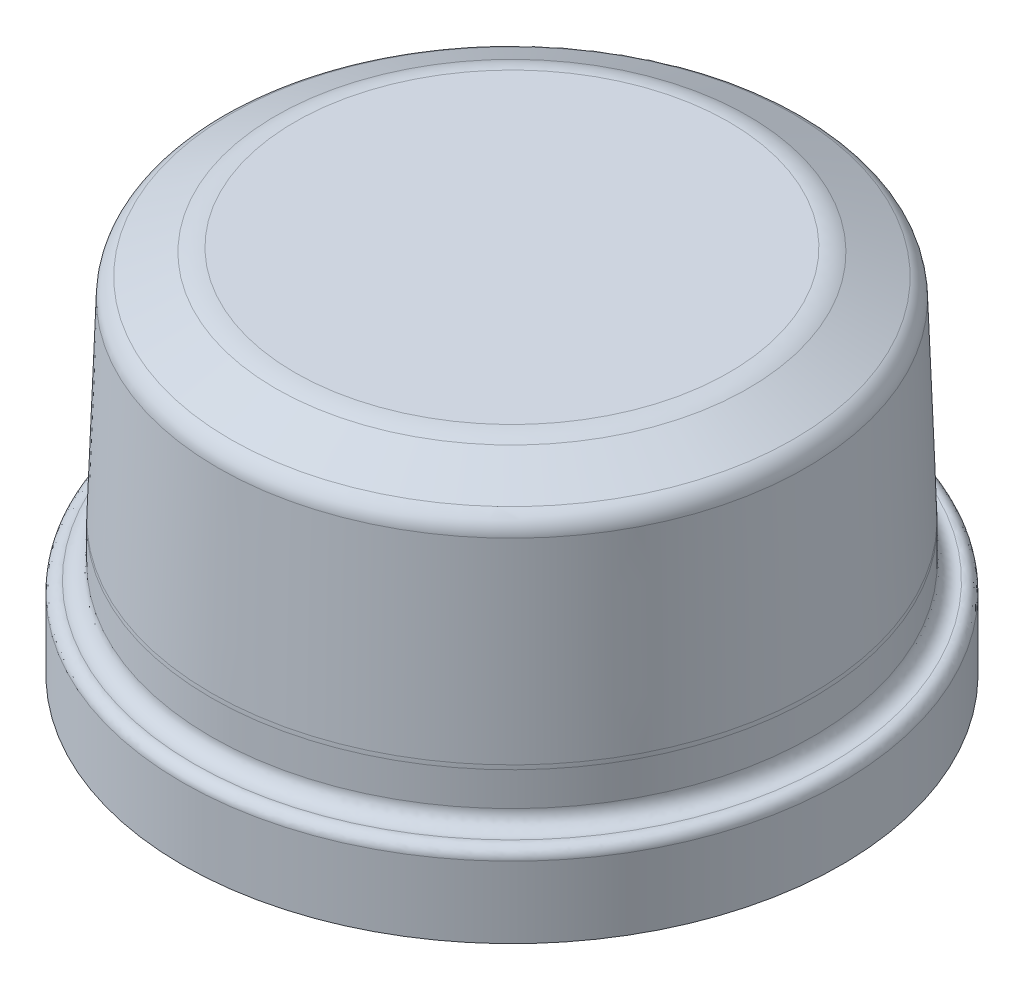
ISO-10303-21;
HEADER;
FILE_DESCRIPTION(('STEP AP214'),'2;1');
FILE_NAME('part.step','',(''),(''),'','','');
FILE_SCHEMA(('AUTOMOTIVE_DESIGN { 1 0 10303 214 1 1 1 1 }'));
ENDSEC;
DATA;
#1=APPLICATION_CONTEXT('core data for automotive mechanical design processes');
#2=APPLICATION_PROTOCOL_DEFINITION('international standard','automotive_design',2000,#1);
#3=PRODUCT_CONTEXT('',#1,'mechanical');
#4=PRODUCT('Part','Part','',(#3));
#5=PRODUCT_RELATED_PRODUCT_CATEGORY('part','',(#4));
#6=PRODUCT_DEFINITION_FORMATION('','',#4);
#7=PRODUCT_DEFINITION_CONTEXT('part definition',#1,'design');
#8=PRODUCT_DEFINITION('design','',#6,#7);
#9=PRODUCT_DEFINITION_SHAPE('','',#8);
#10=(LENGTH_UNIT() NAMED_UNIT(*) SI_UNIT(.MILLI.,.METRE.));
#11=(NAMED_UNIT(*) PLANE_ANGLE_UNIT() SI_UNIT($,.RADIAN.));
#12=(NAMED_UNIT(*) SI_UNIT($,.STERADIAN.) SOLID_ANGLE_UNIT());
#13=UNCERTAINTY_MEASURE_WITH_UNIT(LENGTH_MEASURE(1.E-05),#10,'distance_accuracy_value','');
#14=(GEOMETRIC_REPRESENTATION_CONTEXT(3) GLOBAL_UNCERTAINTY_ASSIGNED_CONTEXT((#13)) GLOBAL_UNIT_ASSIGNED_CONTEXT((#10,
#11,#12)) REPRESENTATION_CONTEXT('',''));
#15=CARTESIAN_POINT('',(0.,0.,0.));
#16=DIRECTION('',(0.,0.,1.));
#17=DIRECTION('',(1.,0.,0.));
#18=AXIS2_PLACEMENT_3D('',#15,#16,#17);
#19=CARTESIAN_POINT('',(0.,-108.124708626121,133.519735500002));
#20=CARTESIAN_POINT('',(0.,-108.789131090786,128.834697888006));
#21=CARTESIAN_POINT('',(0.,-105.359484803612,126.302452500002));
#22=CARTESIAN_POINT('',(0.,-101.837246578522,126.302452500002));
#23=(BOUNDED_CURVE() B_SPLINE_CURVE(3,(#19,#20,#21,#22),.UNSPECIFIED.,.F.,
.F.) B_SPLINE_CURVE_WITH_KNOTS((4,4),(0.,1.),
.UNSPECIFIED.) CURVE() GEOMETRIC_REPRESENTATION_ITEM() RATIONAL_B_SPLINE_CURVE((0.255591691964593,
0.242825015050018,0.327183181081988,0.508666190060503)) REPRESENTATION_ITEM(''));
#24=CARTESIAN_POINT('',(0.,55.,0.));
#25=DIRECTION('',(0.,1.,0.));
#26=AXIS1_PLACEMENT('',#24,#25);
#27=SURFACE_OF_REVOLUTION('',#23,#26);
#28=CARTESIAN_POINT('',(0.,-101.837246578522,0.));
#29=DIRECTION('',(0.,1.,0.));
#30=DIRECTION('',(0.,0.,1.));
#31=AXIS2_PLACEMENT_3D('',#28,#29,#30);
#32=CIRCLE('',#31,126.302452500002);
#33=CARTESIAN_POINT('',(0.,-101.837246578522,126.302452500002));
#34=VERTEX_POINT('',#33);
#35=EDGE_CURVE('E70',#34,#34,#32,.T.);
#36=ORIENTED_EDGE('',*,*,#35,.F.);
#37=EDGE_LOOP('',(#36));
#38=FACE_BOUND('',#37,.T.);
#39=CARTESIAN_POINT('',(0.,-108.124708626121,0.));
#40=DIRECTION('',(0.,1.,0.));
#41=DIRECTION('',(0.,0.,1.));
#42=AXIS2_PLACEMENT_3D('',#39,#40,#41);
#43=CIRCLE('',#42,133.519735500002);
#44=CARTESIAN_POINT('',(0.,-108.124708626121,133.519735500002));
#45=VERTEX_POINT('',#44);
#46=EDGE_CURVE('E10',#45,#45,#43,.T.);
#47=ORIENTED_EDGE('',*,*,#46,.T.);
#48=EDGE_LOOP('',(#47));
#49=FACE_BOUND('',#48,.T.);
#50=ADVANCED_FACE('F35',(#38,#49),#27,.T.);
#51=CARTESIAN_POINT('',(0.,-108.124708626121,133.519735500002));
#52=CARTESIAN_POINT('',(0.,-107.672901350149,136.70556107616));
#53=CARTESIAN_POINT('',(0.,-110.005060825427,138.427487940002));
#54=CARTESIAN_POINT('',(0.,-112.400182818489,138.427487940002));
#55=(BOUNDED_CURVE() B_SPLINE_CURVE(3,(#51,#52,#53,#54),.UNSPECIFIED.,.F.,
.F.) B_SPLINE_CURVE_WITH_KNOTS((4,4),(0.,1.),
.UNSPECIFIED.) CURVE() GEOMETRIC_REPRESENTATION_ITEM() RATIONAL_B_SPLINE_CURVE((0.255591691964592,
0.242825015050017,0.327183181081988,0.508666190060503)) REPRESENTATION_ITEM(''));
#56=CARTESIAN_POINT('',(0.,55.,0.));
#57=DIRECTION('',(0.,1.,0.));
#58=AXIS1_PLACEMENT('',#56,#57);
#59=SURFACE_OF_REVOLUTION('',#55,#58);
#60=CARTESIAN_POINT('',(0.,-112.400182818489,0.));
#61=DIRECTION('',(0.,1.,0.));
#62=DIRECTION('',(0.,0.,1.));
#63=AXIS2_PLACEMENT_3D('',#60,#61,#62);
#64=CIRCLE('',#63,138.427487940002);
#65=CARTESIAN_POINT('',(0.,-112.400182818489,138.427487940002));
#66=VERTEX_POINT('',#65);
#67=EDGE_CURVE('E42',#66,#66,#64,.T.);
#68=ORIENTED_EDGE('',*,*,#67,.T.);
#69=EDGE_LOOP('',(#68));
#70=FACE_BOUND('',#69,.T.);
#71=ORIENTED_EDGE('',*,*,#46,.F.);
#72=EDGE_LOOP('',(#71));
#73=FACE_BOUND('',#72,.T.);
#74=ADVANCED_FACE('F101',(#70,#73),#59,.F.);
#75=CARTESIAN_POINT('',(0.,55.,0.));
#76=DIRECTION('',(0.,1.,0.));
#77=DIRECTION('',(0.,0.,1.));
#78=AXIS2_PLACEMENT_3D('',#75,#76,#77);
#79=CYLINDRICAL_SURFACE('',#78,138.427487940002);
#80=CARTESIAN_POINT('',(0.,-142.400182818489,0.));
#81=DIRECTION('',(0.,1.,0.));
#82=DIRECTION('',(0.,0.,1.));
#83=AXIS2_PLACEMENT_3D('',#80,#81,#82);
#84=CIRCLE('',#83,138.427487940002);
#85=CARTESIAN_POINT('',(0.,-142.400182818489,138.427487940002));
#86=VERTEX_POINT('',#85);
#87=EDGE_CURVE('E46',#86,#86,#84,.T.);
#88=ORIENTED_EDGE('',*,*,#87,.T.);
#89=EDGE_LOOP('',(#88));
#90=FACE_BOUND('',#89,.T.);
#91=ORIENTED_EDGE('',*,*,#67,.F.);
#92=EDGE_LOOP('',(#91));
#93=FACE_BOUND('',#92,.T.);
#94=ADVANCED_FACE('F98',(#90,#93),#79,.T.);
#95=CARTESIAN_POINT('',(0.,-142.400182818489,0.));
#96=DIRECTION('',(0.,1.,0.));
#97=DIRECTION('',(0.,0.,1.));
#98=AXIS2_PLACEMENT_3D('',#95,#96,#97);
#99=PLANE('',#98);
#100=ORIENTED_EDGE('',*,*,#87,.F.);
#101=EDGE_LOOP('',(#100));
#102=FACE_BOUND('',#101,.T.);
#103=ADVANCED_FACE('F94',(#102),#99,.F.);
#104=CARTESIAN_POINT('',(0.,13.0472913738795,0.));
#105=DIRECTION('',(0.,-1.,0.));
#106=DIRECTION('',(0.,0.,-1.));
#107=AXIS2_PLACEMENT_3D('',#104,#105,#106);
#108=PLANE('',#107);
#109=CARTESIAN_POINT('',(0.,13.0472913738796,0.));
#110=DIRECTION('',(0.,1.,0.));
#111=DIRECTION('',(0.,0.,1.));
#112=AXIS2_PLACEMENT_3D('',#109,#110,#111);
#113=CIRCLE('',#112,91.1860000000005);
#114=CARTESIAN_POINT('',(0.,13.0472913738796,91.1860000000005));
#115=VERTEX_POINT('',#114);
#116=EDGE_CURVE('E50',#115,#115,#113,.T.);
#117=ORIENTED_EDGE('',*,*,#116,.T.);
#118=EDGE_LOOP('',(#117));
#119=FACE_BOUND('',#118,.T.);
#120=ADVANCED_FACE('F89',(#119),#108,.F.);
#121=CARTESIAN_POINT('',(0.,13.0472913738796,91.1860000000004));
#122=CARTESIAN_POINT('',(0.,13.0472913738796,93.9930756489206));
#123=CARTESIAN_POINT('',(0.,12.4331662406387,96.7096580848795));
#124=CARTESIAN_POINT('',(0.,11.2624547169268,99.2127252525065));
#125=(BOUNDED_CURVE() B_SPLINE_CURVE(3,(#121,#122,#123,#124),.UNSPECIFIED.,.F.,
.F.) B_SPLINE_CURVE_WITH_KNOTS((4,4),(0.,1.),
.UNSPECIFIED.) CURVE() GEOMETRIC_REPRESENTATION_ITEM() RATIONAL_B_SPLINE_CURVE((0.254333095030252,
0.254333095030252,0.258499793724843,0.266833191114025)) REPRESENTATION_ITEM(''));
#126=CARTESIAN_POINT('',(0.,55.,0.));
#127=DIRECTION('',(0.,1.,0.));
#128=AXIS1_PLACEMENT('',#126,#127);
#129=SURFACE_OF_REVOLUTION('',#125,#128);
#130=CARTESIAN_POINT('',(0.,11.2624547169268,0.));
#131=DIRECTION('',(0.,1.,0.));
#132=DIRECTION('',(0.,0.,1.));
#133=AXIS2_PLACEMENT_3D('',#130,#131,#132);
#134=CIRCLE('',#133,99.2127252525065);
#135=CARTESIAN_POINT('',(0.,11.2624547169268,99.2127252525065));
#136=VERTEX_POINT('',#135);
#137=EDGE_CURVE('E55',#136,#136,#134,.T.);
#138=ORIENTED_EDGE('',*,*,#137,.T.);
#139=EDGE_LOOP('',(#138));
#140=FACE_BOUND('',#139,.T.);
#141=ORIENTED_EDGE('',*,*,#116,.F.);
#142=EDGE_LOOP('',(#141));
#143=FACE_BOUND('',#142,.T.);
#144=ADVANCED_FACE('F84',(#140,#143),#129,.F.);
#145=CARTESIAN_POINT('',(0.,11.2624547169268,0.));
#146=DIRECTION('',(0.,-1.,0.));
#147=DIRECTION('',(0.,0.,-1.));
#148=AXIS2_PLACEMENT_3D('',#145,#146,#147);
#149=CONICAL_SURFACE('',#148,99.2127252525065,1.13331210913781);
#150=CARTESIAN_POINT('',(0.,2.34433380954261,0.));
#151=DIRECTION('',(0.,1.,0.));
#152=DIRECTION('',(0.,0.,1.));
#153=AXIS2_PLACEMENT_3D('',#150,#151,#152);
#154=CIRCLE('',#153,118.280322340321);
#155=CARTESIAN_POINT('',(0.,2.34433380954261,118.280322340321));
#156=VERTEX_POINT('',#155);
#157=EDGE_CURVE('E58',#156,#156,#154,.T.);
#158=ORIENTED_EDGE('',*,*,#157,.T.);
#159=EDGE_LOOP('',(#158));
#160=FACE_BOUND('',#159,.T.);
#161=ORIENTED_EDGE('',*,*,#137,.F.);
#162=EDGE_LOOP('',(#161));
#163=FACE_BOUND('',#162,.T.);
#164=ADVANCED_FACE('F88',(#160,#163),#149,.T.);
#165=CARTESIAN_POINT('',(0.,-5.80804951971132,0.));
#166=DIRECTION('',(0.,1.,0.));
#167=DIRECTION('',(0.,0.,1.));
#168=AXIS2_PLACEMENT_3D('',#165,#166,#167);
#169=TOROIDAL_SURFACE('',#168,114.46736468872,9.);
#170=CARTESIAN_POINT('',(0.,-5.49395404938885,0.));
#171=DIRECTION('',(0.,1.,0.));
#172=DIRECTION('',(0.,0.,1.));
#173=AXIS2_PLACEMENT_3D('',#170,#171,#172);
#174=CIRCLE('',#173,123.461882131892);
#175=CARTESIAN_POINT('',(0.,-5.49395404938885,123.461882131892));
#176=VERTEX_POINT('',#175);
#177=EDGE_CURVE('E61',#176,#176,#174,.T.);
#178=ORIENTED_EDGE('',*,*,#177,.T.);
#179=EDGE_LOOP('',(#178));
#180=FACE_BOUND('',#179,.T.);
#181=ORIENTED_EDGE('',*,*,#157,.F.);
#182=EDGE_LOOP('',(#181));
#183=FACE_BOUND('',#182,.T.);
#184=ADVANCED_FACE('F127',(#180,#183),#169,.T.);
#185=CARTESIAN_POINT('',(0.,-5.49395404938885,0.));
#186=DIRECTION('',(0.,-1.,0.));
#187=DIRECTION('',(0.,0.,-1.));
#188=AXIS2_PLACEMENT_3D('',#185,#186,#187);
#189=CONICAL_SURFACE('',#188,123.461882131892,0.0349065850398867);
#190=CARTESIAN_POINT('',(0.,-85.9650249898077,0.));
#191=DIRECTION('',(0.,1.,0.));
#192=DIRECTION('',(0.,0.,1.));
#193=AXIS2_PLACEMENT_3D('',#190,#191,#192);
#194=CIRCLE('',#193,126.271993850957);
#195=CARTESIAN_POINT('',(0.,-85.9650249898077,126.271993850957));
#196=VERTEX_POINT('',#195);
#197=EDGE_CURVE('E64',#196,#196,#194,.T.);
#198=ORIENTED_EDGE('',*,*,#197,.T.);
#199=EDGE_LOOP('',(#198));
#200=FACE_BOUND('',#199,.T.);
#201=ORIENTED_EDGE('',*,*,#177,.F.);
#202=EDGE_LOOP('',(#201));
#203=FACE_BOUND('',#202,.T.);
#204=ADVANCED_FACE('F121',(#200,#203),#189,.T.);
#205=CARTESIAN_POINT('',(0.,-87.709999824933,0.));
#206=DIRECTION('',(0.,1.,0.));
#207=DIRECTION('',(0.,0.,1.));
#208=AXIS2_PLACEMENT_3D('',#205,#206,#207);
#209=TOROIDAL_SURFACE('',#208,76.302452500002,50.);
#210=ORIENTED_EDGE('',*,*,#197,.F.);
#211=EDGE_LOOP('',(#210));
#212=FACE_BOUND('',#211,.T.);
#213=CARTESIAN_POINT('',(0.,-87.7099998249327,0.));
#214=DIRECTION('',(0.,1.,0.));
#215=DIRECTION('',(0.,0.,1.));
#216=AXIS2_PLACEMENT_3D('',#213,#214,#215);
#217=CIRCLE('',#216,126.302452500002);
#218=CARTESIAN_POINT('',(0.,-87.7099998249327,126.302452500002));
#219=VERTEX_POINT('',#218);
#220=EDGE_CURVE('E67',#219,#219,#217,.T.);
#221=ORIENTED_EDGE('',*,*,#220,.T.);
#222=EDGE_LOOP('',(#221));
#223=FACE_BOUND('',#222,.T.);
#224=ADVANCED_FACE('F116',(#212,#223),#209,.T.);
#225=CARTESIAN_POINT('',(0.,55.,0.));
#226=DIRECTION('',(0.,1.,0.));
#227=DIRECTION('',(0.,0.,1.));
#228=AXIS2_PLACEMENT_3D('',#225,#226,#227);
#229=CYLINDRICAL_SURFACE('',#228,126.302452500002);
#230=ORIENTED_EDGE('',*,*,#35,.T.);
#231=EDGE_LOOP('',(#230));
#232=FACE_BOUND('',#231,.T.);
#233=ORIENTED_EDGE('',*,*,#220,.F.);
#234=EDGE_LOOP('',(#233));
#235=FACE_BOUND('',#234,.T.);
#236=ADVANCED_FACE('F113',(#232,#235),#229,.T.);
#237=CLOSED_SHELL('',(#50,#74,#94,#103,#120,#144,#164,#184,#204,#224,#236));
#238=MANIFOLD_SOLID_BREP('B2',#237);
#239=ADVANCED_BREP_SHAPE_REPRESENTATION('',(#18,#238),#14);
#240=SHAPE_DEFINITION_REPRESENTATION(#9,#239);
ENDSEC;
END-ISO-10303-21;
